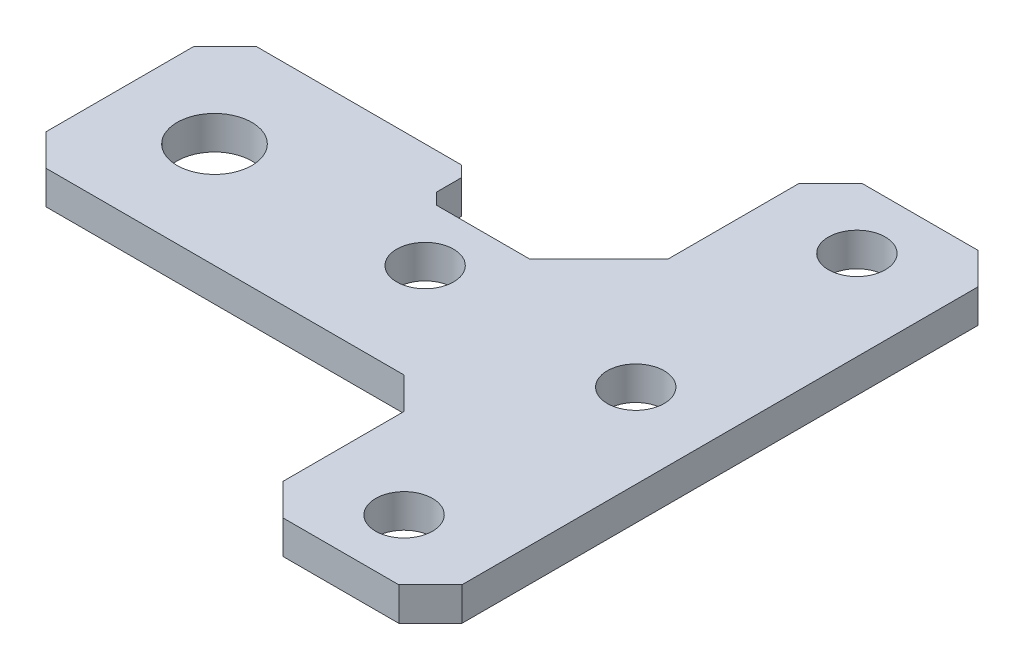
ISO-10303-21;
HEADER;
FILE_DESCRIPTION(('STEP AP214'),'2;1');
FILE_NAME('part.step','',(''),(''),'','','');
FILE_SCHEMA(('AUTOMOTIVE_DESIGN { 1 0 10303 214 1 1 1 1 }'));
ENDSEC;
DATA;
#1=APPLICATION_CONTEXT('core data for automotive mechanical design processes');
#2=APPLICATION_PROTOCOL_DEFINITION('international standard','automotive_design',2000,#1);
#3=PRODUCT_CONTEXT('',#1,'mechanical');
#4=PRODUCT('Part','Part','',(#3));
#5=PRODUCT_RELATED_PRODUCT_CATEGORY('part','',(#4));
#6=PRODUCT_DEFINITION_FORMATION('','',#4);
#7=PRODUCT_DEFINITION_CONTEXT('part definition',#1,'design');
#8=PRODUCT_DEFINITION('design','',#6,#7);
#9=PRODUCT_DEFINITION_SHAPE('','',#8);
#10=(LENGTH_UNIT() NAMED_UNIT(*) SI_UNIT(.MILLI.,.METRE.));
#11=(NAMED_UNIT(*) PLANE_ANGLE_UNIT() SI_UNIT($,.RADIAN.));
#12=(NAMED_UNIT(*) SI_UNIT($,.STERADIAN.) SOLID_ANGLE_UNIT());
#13=UNCERTAINTY_MEASURE_WITH_UNIT(LENGTH_MEASURE(1.E-05),#10,'distance_accuracy_value','');
#14=(GEOMETRIC_REPRESENTATION_CONTEXT(3) GLOBAL_UNCERTAINTY_ASSIGNED_CONTEXT((#13)) GLOBAL_UNIT_ASSIGNED_CONTEXT((#10,
#11,#12)) REPRESENTATION_CONTEXT('',''));
#15=CARTESIAN_POINT('',(0.,0.,0.));
#16=DIRECTION('',(0.,0.,1.));
#17=DIRECTION('',(1.,0.,0.));
#18=AXIS2_PLACEMENT_3D('',#15,#16,#17);
#19=CARTESIAN_POINT('',(0.,3.175,-20.));
#20=DIRECTION('',(0.,0.,1.));
#21=DIRECTION('',(1.,0.,0.));
#22=AXIS2_PLACEMENT_3D('',#19,#20,#21);
#23=PLANE('',#22);
#24=DIRECTION('',(-1.,0.,0.));
#25=VECTOR('',#24,1.);
#26=CARTESIAN_POINT('',(0.,3.175,-20.));
#27=LINE('',#26,#25);
#28=CARTESIAN_POINT('',(22.4393398282202,3.175,-20.));
#29=VERTEX_POINT('',#28);
#30=CARTESIAN_POINT('',(3.,3.175,-20.));
#31=VERTEX_POINT('',#30);
#32=EDGE_CURVE('E210',#29,#31,#27,.T.);
#33=ORIENTED_EDGE('',*,*,#32,.F.);
#34=DIRECTION('',(0.,-1.,0.));
#35=VECTOR('',#34,1.);
#36=CARTESIAN_POINT('',(22.4393398282202,3.175,-20.));
#37=LINE('',#36,#35);
#38=CARTESIAN_POINT('',(22.4393398282202,0.,-20.));
#39=VERTEX_POINT('',#38);
#40=EDGE_CURVE('E264',#29,#39,#37,.T.);
#41=ORIENTED_EDGE('',*,*,#40,.T.);
#42=DIRECTION('',(-1.,0.,0.));
#43=VECTOR('',#42,1.);
#44=CARTESIAN_POINT('',(0.,0.,-20.));
#45=LINE('',#44,#43);
#46=CARTESIAN_POINT('',(3.,0.,-20.));
#47=VERTEX_POINT('',#46);
#48=EDGE_CURVE('E197',#39,#47,#45,.T.);
#49=ORIENTED_EDGE('',*,*,#48,.T.);
#50=DIRECTION('',(0.,1.,0.));
#51=VECTOR('',#50,1.);
#52=CARTESIAN_POINT('',(3.,3.175,-20.));
#53=LINE('',#52,#51);
#54=EDGE_CURVE('E227',#47,#31,#53,.T.);
#55=ORIENTED_EDGE('',*,*,#54,.T.);
#56=EDGE_LOOP('',(#33,#41,#49,#55));
#57=FACE_BOUND('',#56,.T.);
#58=ADVANCED_FACE('F33',(#57),#23,.F.);
#59=CARTESIAN_POINT('',(0.,3.175,0.));
#60=DIRECTION('',(0.,-1.,0.));
#61=DIRECTION('',(0.,0.,-1.));
#62=AXIS2_PLACEMENT_3D('',#59,#60,#61);
#63=PLANE('',#62);
#64=DIRECTION('',(0.,0.,1.));
#65=VECTOR('',#64,1.);
#66=CARTESIAN_POINT('',(23.5,3.175,-16.5606601717798));
#67=LINE('',#66,#65);
#68=CARTESIAN_POINT('',(23.5,3.175,-18.9393398282202));
#69=VERTEX_POINT('',#68);
#70=CARTESIAN_POINT('',(23.5,3.175,-16.5606601717798));
#71=VERTEX_POINT('',#70);
#72=EDGE_CURVE('E423',#69,#71,#67,.T.);
#73=ORIENTED_EDGE('',*,*,#72,.F.);
#74=DIRECTION('',(0.707106781186548,0.,0.707106781186548));
#75=VECTOR('',#74,1.);
#76=CARTESIAN_POINT('',(22.4393398282202,3.175,-20.));
#77=LINE('',#76,#75);
#78=EDGE_CURVE('E271',#69,#29,#77,.F.);
#79=ORIENTED_EDGE('',*,*,#78,.T.);
#80=ORIENTED_EDGE('',*,*,#32,.T.);
#81=DIRECTION('',(0.707106781186548,0.,-0.707106781186547));
#82=VECTOR('',#81,1.);
#83=CARTESIAN_POINT('',(0.,3.175,-17.));
#84=LINE('',#83,#82);
#85=CARTESIAN_POINT('',(0.,3.175,-17.));
#86=VERTEX_POINT('',#85);
#87=EDGE_CURVE('E240',#31,#86,#84,.F.);
#88=ORIENTED_EDGE('',*,*,#87,.T.);
#89=DIRECTION('',(0.,0.,1.));
#90=VECTOR('',#89,1.);
#91=CARTESIAN_POINT('',(0.,3.175,0.));
#92=LINE('',#91,#90);
#93=CARTESIAN_POINT('',(0.,3.175,-3.));
#94=VERTEX_POINT('',#93);
#95=EDGE_CURVE('E200',#86,#94,#92,.T.);
#96=ORIENTED_EDGE('',*,*,#95,.T.);
#97=DIRECTION('',(-0.707106781186547,0.,-0.707106781186548));
#98=VECTOR('',#97,1.);
#99=CARTESIAN_POINT('',(3.,3.175,0.));
#100=LINE('',#99,#98);
#101=CARTESIAN_POINT('',(3.,3.175,0.));
#102=VERTEX_POINT('',#101);
#103=EDGE_CURVE('E238',#94,#102,#100,.F.);
#104=ORIENTED_EDGE('',*,*,#103,.T.);
#105=DIRECTION('',(1.,0.,0.));
#106=VECTOR('',#105,1.);
#107=CARTESIAN_POINT('',(0.,3.175,0.));
#108=LINE('',#107,#106);
#109=CARTESIAN_POINT('',(37.,3.175,0.));
#110=VERTEX_POINT('',#109);
#111=EDGE_CURVE('E345',#102,#110,#108,.T.);
#112=ORIENTED_EDGE('',*,*,#111,.T.);
#113=DIRECTION('',(-0.707106781186544,0.,-0.707106781186551));
#114=VECTOR('',#113,1.);
#115=CARTESIAN_POINT('',(18.5000000000002,3.175,-18.5));
#116=LINE('',#115,#114);
#117=CARTESIAN_POINT('',(40.,3.175,3.00000000000002));
#118=VERTEX_POINT('',#117);
#119=EDGE_CURVE('E11',#110,#118,#116,.F.);
#120=ORIENTED_EDGE('',*,*,#119,.T.);
#121=DIRECTION('',(0.,0.,1.));
#122=VECTOR('',#121,1.);
#123=CARTESIAN_POINT('',(40.,3.175,17.5));
#124=LINE('',#123,#122);
#125=CARTESIAN_POINT('',(40.,3.175,14.5));
#126=VERTEX_POINT('',#125);
#127=EDGE_CURVE('E281',#118,#126,#124,.T.);
#128=ORIENTED_EDGE('',*,*,#127,.T.);
#129=DIRECTION('',(-0.707106781186546,0.,-0.707106781186549));
#130=VECTOR('',#129,1.);
#131=CARTESIAN_POINT('',(43.,3.175,17.5));
#132=LINE('',#131,#130);
#133=CARTESIAN_POINT('',(43.,3.175,17.5));
#134=VERTEX_POINT('',#133);
#135=EDGE_CURVE('E234',#126,#134,#132,.F.);
#136=ORIENTED_EDGE('',*,*,#135,.T.);
#137=DIRECTION('',(1.,0.,0.));
#138=VECTOR('',#137,1.);
#139=CARTESIAN_POINT('',(40.,3.175,17.5));
#140=LINE('',#139,#138);
#141=CARTESIAN_POINT('',(54.,3.175,17.5));
#142=VERTEX_POINT('',#141);
#143=EDGE_CURVE('E322',#134,#142,#140,.T.);
#144=ORIENTED_EDGE('',*,*,#143,.T.);
#145=DIRECTION('',(-0.707106781186548,0.,0.707106781186547));
#146=VECTOR('',#145,1.);
#147=CARTESIAN_POINT('',(57.,3.175,14.5));
#148=LINE('',#147,#146);
#149=CARTESIAN_POINT('',(57.,3.175,14.5));
#150=VERTEX_POINT('',#149);
#151=EDGE_CURVE('E236',#142,#150,#148,.F.);
#152=ORIENTED_EDGE('',*,*,#151,.T.);
#153=DIRECTION('',(0.,0.,-1.));
#154=VECTOR('',#153,1.);
#155=CARTESIAN_POINT('',(57.,3.175,17.5));
#156=LINE('',#155,#154);
#157=CARTESIAN_POINT('',(57.,3.175,-34.5));
#158=VERTEX_POINT('',#157);
#159=EDGE_CURVE('E314',#150,#158,#156,.T.);
#160=ORIENTED_EDGE('',*,*,#159,.T.);
#161=DIRECTION('',(0.707106781186548,0.,0.707106781186547));
#162=VECTOR('',#161,1.);
#163=CARTESIAN_POINT('',(54.,3.175,-37.5));
#164=LINE('',#163,#162);
#165=CARTESIAN_POINT('',(54.,3.175,-37.5));
#166=VERTEX_POINT('',#165);
#167=EDGE_CURVE('E232',#158,#166,#164,.F.);
#168=ORIENTED_EDGE('',*,*,#167,.T.);
#169=DIRECTION('',(-1.,0.,0.));
#170=VECTOR('',#169,1.);
#171=CARTESIAN_POINT('',(40.,3.175,-37.5));
#172=LINE('',#171,#170);
#173=CARTESIAN_POINT('',(43.,3.175,-37.5));
#174=VERTEX_POINT('',#173);
#175=EDGE_CURVE('E312',#166,#174,#172,.T.);
#176=ORIENTED_EDGE('',*,*,#175,.T.);
#177=DIRECTION('',(0.70710678118655,0.,-0.707106781186545));
#178=VECTOR('',#177,1.);
#179=CARTESIAN_POINT('',(40.,3.175,-34.5));
#180=LINE('',#179,#178);
#181=CARTESIAN_POINT('',(40.,3.175,-34.5));
#182=VERTEX_POINT('',#181);
#183=EDGE_CURVE('E230',#174,#182,#180,.F.);
#184=ORIENTED_EDGE('',*,*,#183,.T.);
#185=DIRECTION('',(0.,0.,1.));
#186=VECTOR('',#185,1.);
#187=CARTESIAN_POINT('',(40.,3.175,-20.));
#188=LINE('',#187,#186);
#189=CARTESIAN_POINT('',(40.,3.175,-22.0606601717798));
#190=VERTEX_POINT('',#189);
#191=EDGE_CURVE('E319',#182,#190,#188,.T.);
#192=ORIENTED_EDGE('',*,*,#191,.T.);
#193=DIRECTION('',(0.707106781186551,0.,-0.707106781186544));
#194=VECTOR('',#193,1.);
#195=CARTESIAN_POINT('',(31.8393398282202,3.175,-13.9));
#196=LINE('',#195,#194);
#197=CARTESIAN_POINT('',(33.4393398282202,3.175,-15.5));
#198=VERTEX_POINT('',#197);
#199=EDGE_CURVE('E188',#198,#190,#196,.T.);
#200=ORIENTED_EDGE('',*,*,#199,.F.);
#201=DIRECTION('',(-1.,0.,0.));
#202=VECTOR('',#201,1.);
#203=CARTESIAN_POINT('',(24.5606601717798,3.175,-15.5));
#204=LINE('',#203,#202);
#205=CARTESIAN_POINT('',(24.5606601717798,3.175,-15.5));
#206=VERTEX_POINT('',#205);
#207=EDGE_CURVE('E182',#198,#206,#204,.T.);
#208=ORIENTED_EDGE('',*,*,#207,.T.);
#209=DIRECTION('',(0.707106781186551,0.,0.707106781186544));
#210=VECTOR('',#209,1.);
#211=CARTESIAN_POINT('',(23.5,3.175,-16.5606601717798));
#212=LINE('',#211,#210);
#213=EDGE_CURVE('E425',#71,#206,#212,.T.);
#214=ORIENTED_EDGE('',*,*,#213,.F.);
#215=EDGE_LOOP('',(#73,#79,#80,#88,#96,#104,#112,#120,#128,#136,#144,#152,#160,#168,#176,#184,
#192,#200,#208,#214));
#216=FACE_BOUND('',#215,.T.);
#217=CARTESIAN_POINT('',(29.,3.175,-10.));
#218=DIRECTION('',(0.,1.,0.));
#219=DIRECTION('',(0.,0.,1.));
#220=AXIS2_PLACEMENT_3D('',#217,#218,#219);
#221=CIRCLE('',#220,2.7);
#222=CARTESIAN_POINT('',(29.,3.175,-7.3));
#223=VERTEX_POINT('',#222);
#224=EDGE_CURVE('E327',#223,#223,#221,.T.);
#225=ORIENTED_EDGE('',*,*,#224,.F.);
#226=EDGE_LOOP('',(#225));
#227=FACE_BOUND('',#226,.T.);
#228=CARTESIAN_POINT('',(9.,3.175,-10.));
#229=DIRECTION('',(0.,1.,0.));
#230=DIRECTION('',(0.,0.,1.));
#231=AXIS2_PLACEMENT_3D('',#228,#229,#230);
#232=CIRCLE('',#231,3.55);
#233=CARTESIAN_POINT('',(9.,3.175,-6.45));
#234=VERTEX_POINT('',#233);
#235=EDGE_CURVE('E337',#234,#234,#232,.T.);
#236=ORIENTED_EDGE('',*,*,#235,.F.);
#237=EDGE_LOOP('',(#236));
#238=FACE_BOUND('',#237,.T.);
#239=CARTESIAN_POINT('',(48.5,3.175,-31.5));
#240=DIRECTION('',(0.,1.,0.));
#241=DIRECTION('',(0.,0.,1.));
#242=AXIS2_PLACEMENT_3D('',#239,#240,#241);
#243=CIRCLE('',#242,2.7);
#244=CARTESIAN_POINT('',(48.5,3.175,-28.8));
#245=VERTEX_POINT('',#244);
#246=EDGE_CURVE('E447',#245,#245,#243,.T.);
#247=ORIENTED_EDGE('',*,*,#246,.F.);
#248=EDGE_LOOP('',(#247));
#249=FACE_BOUND('',#248,.T.);
#250=CARTESIAN_POINT('',(48.5,3.175,11.5));
#251=DIRECTION('',(0.,1.,0.));
#252=DIRECTION('',(0.,0.,1.));
#253=AXIS2_PLACEMENT_3D('',#250,#251,#252);
#254=CIRCLE('',#253,2.70000000000001);
#255=CARTESIAN_POINT('',(48.5,3.175,14.2));
#256=VERTEX_POINT('',#255);
#257=EDGE_CURVE('E441',#256,#256,#254,.T.);
#258=ORIENTED_EDGE('',*,*,#257,.F.);
#259=EDGE_LOOP('',(#258));
#260=FACE_BOUND('',#259,.T.);
#261=CARTESIAN_POINT('',(49.,3.175,-10.));
#262=DIRECTION('',(0.,1.,0.));
#263=DIRECTION('',(0.,0.,1.));
#264=AXIS2_PLACEMENT_3D('',#261,#262,#263);
#265=CIRCLE('',#264,2.7);
#266=CARTESIAN_POINT('',(49.,3.175,-7.30000000000001));
#267=VERTEX_POINT('',#266);
#268=EDGE_CURVE('E435',#267,#267,#265,.T.);
#269=ORIENTED_EDGE('',*,*,#268,.F.);
#270=EDGE_LOOP('',(#269));
#271=FACE_BOUND('',#270,.T.);
#272=ADVANCED_FACE('F310',(#216,#227,#238,#249,#260,#271),#63,.F.);
#273=CARTESIAN_POINT('',(0.,0.,0.));
#274=DIRECTION('',(0.,-1.,0.));
#275=DIRECTION('',(0.,0.,-1.));
#276=AXIS2_PLACEMENT_3D('',#273,#274,#275);
#277=PLANE('',#276);
#278=ORIENTED_EDGE('',*,*,#48,.F.);
#279=DIRECTION('',(-0.707106781186548,0.,-0.707106781186548));
#280=VECTOR('',#279,1.);
#281=CARTESIAN_POINT('',(21.2196699141101,0.,-21.2196699141101));
#282=LINE('',#281,#280);
#283=CARTESIAN_POINT('',(23.5,0.,-18.9393398282202));
#284=VERTEX_POINT('',#283);
#285=EDGE_CURVE('E267',#39,#284,#282,.F.);
#286=ORIENTED_EDGE('',*,*,#285,.T.);
#287=DIRECTION('',(0.,0.,1.));
#288=VECTOR('',#287,1.);
#289=CARTESIAN_POINT('',(23.5,0.,-16.5606601717798));
#290=LINE('',#289,#288);
#291=CARTESIAN_POINT('',(23.5,0.,-16.5606601717798));
#292=VERTEX_POINT('',#291);
#293=EDGE_CURVE('E181',#284,#292,#290,.T.);
#294=ORIENTED_EDGE('',*,*,#293,.T.);
#295=DIRECTION('',(0.707106781186551,0.,0.707106781186544));
#296=VECTOR('',#295,1.);
#297=CARTESIAN_POINT('',(23.5,0.,-16.5606601717798));
#298=LINE('',#297,#296);
#299=CARTESIAN_POINT('',(24.5606601717798,0.,-15.5));
#300=VERTEX_POINT('',#299);
#301=EDGE_CURVE('E432',#292,#300,#298,.T.);
#302=ORIENTED_EDGE('',*,*,#301,.T.);
#303=DIRECTION('',(1.,0.,0.));
#304=VECTOR('',#303,1.);
#305=CARTESIAN_POINT('',(24.5606601717798,0.,-15.5));
#306=LINE('',#305,#304);
#307=CARTESIAN_POINT('',(33.4393398282202,0.,-15.5));
#308=VERTEX_POINT('',#307);
#309=EDGE_CURVE('E178',#300,#308,#306,.T.);
#310=ORIENTED_EDGE('',*,*,#309,.T.);
#311=DIRECTION('',(0.707106781186551,0.,-0.707106781186544));
#312=VECTOR('',#311,1.);
#313=CARTESIAN_POINT('',(31.8393398282202,0.,-13.9));
#314=LINE('',#313,#312);
#315=CARTESIAN_POINT('',(40.,0.,-22.0606601717798));
#316=VERTEX_POINT('',#315);
#317=EDGE_CURVE('E169',#308,#316,#314,.T.);
#318=ORIENTED_EDGE('',*,*,#317,.T.);
#319=DIRECTION('',(0.,0.,1.));
#320=VECTOR('',#319,1.);
#321=CARTESIAN_POINT('',(40.,0.,-20.));
#322=LINE('',#321,#320);
#323=CARTESIAN_POINT('',(40.,0.,-34.5));
#324=VERTEX_POINT('',#323);
#325=EDGE_CURVE('E175',#324,#316,#322,.T.);
#326=ORIENTED_EDGE('',*,*,#325,.F.);
#327=DIRECTION('',(-0.70710678118655,0.,0.707106781186545));
#328=VECTOR('',#327,1.);
#329=CARTESIAN_POINT('',(2.74999999999986,0.,2.74999999999988));
#330=LINE('',#329,#328);
#331=CARTESIAN_POINT('',(43.,0.,-37.5));
#332=VERTEX_POINT('',#331);
#333=EDGE_CURVE('E213',#324,#332,#330,.F.);
#334=ORIENTED_EDGE('',*,*,#333,.T.);
#335=DIRECTION('',(-1.,0.,0.));
#336=VECTOR('',#335,1.);
#337=CARTESIAN_POINT('',(40.,0.,-37.5));
#338=LINE('',#337,#336);
#339=CARTESIAN_POINT('',(54.,0.,-37.5));
#340=VERTEX_POINT('',#339);
#341=EDGE_CURVE('E198',#340,#332,#338,.T.);
#342=ORIENTED_EDGE('',*,*,#341,.F.);
#343=DIRECTION('',(-0.707106781186548,0.,-0.707106781186547));
#344=VECTOR('',#343,1.);
#345=CARTESIAN_POINT('',(45.7499999999999,0.,-45.75));
#346=LINE('',#345,#344);
#347=CARTESIAN_POINT('',(57.,0.,-34.5));
#348=VERTEX_POINT('',#347);
#349=EDGE_CURVE('E215',#340,#348,#346,.F.);
#350=ORIENTED_EDGE('',*,*,#349,.T.);
#351=DIRECTION('',(0.,0.,-1.));
#352=VECTOR('',#351,1.);
#353=CARTESIAN_POINT('',(57.,0.,17.5));
#354=LINE('',#353,#352);
#355=CARTESIAN_POINT('',(57.,0.,14.5));
#356=VERTEX_POINT('',#355);
#357=EDGE_CURVE('E203',#356,#348,#354,.T.);
#358=ORIENTED_EDGE('',*,*,#357,.F.);
#359=DIRECTION('',(0.707106781186548,0.,-0.707106781186547));
#360=VECTOR('',#359,1.);
#361=CARTESIAN_POINT('',(35.7499999999999,0.,35.75));
#362=LINE('',#361,#360);
#363=CARTESIAN_POINT('',(54.,0.,17.5));
#364=VERTEX_POINT('',#363);
#365=EDGE_CURVE('E220',#356,#364,#362,.F.);
#366=ORIENTED_EDGE('',*,*,#365,.T.);
#367=DIRECTION('',(1.,0.,0.));
#368=VECTOR('',#367,1.);
#369=CARTESIAN_POINT('',(40.,0.,17.5));
#370=LINE('',#369,#368);
#371=CARTESIAN_POINT('',(43.,0.,17.5));
#372=VERTEX_POINT('',#371);
#373=EDGE_CURVE('E286',#372,#364,#370,.T.);
#374=ORIENTED_EDGE('',*,*,#373,.F.);
#375=DIRECTION('',(0.707106781186546,0.,0.707106781186549));
#376=VECTOR('',#375,1.);
#377=CARTESIAN_POINT('',(12.7500000000001,0.,-12.75));
#378=LINE('',#377,#376);
#379=CARTESIAN_POINT('',(40.,0.,14.5));
#380=VERTEX_POINT('',#379);
#381=EDGE_CURVE('E217',#372,#380,#378,.F.);
#382=ORIENTED_EDGE('',*,*,#381,.T.);
#383=DIRECTION('',(0.,0.,1.));
#384=VECTOR('',#383,1.);
#385=CARTESIAN_POINT('',(40.,0.,17.5));
#386=LINE('',#385,#384);
#387=CARTESIAN_POINT('',(40.,0.,3.00000000000002));
#388=VERTEX_POINT('',#387);
#389=EDGE_CURVE('E280',#388,#380,#386,.T.);
#390=ORIENTED_EDGE('',*,*,#389,.F.);
#391=DIRECTION('',(0.707106781186544,0.,0.707106781186551));
#392=VECTOR('',#391,1.);
#393=CARTESIAN_POINT('',(40.,0.,3.00000000000002));
#394=LINE('',#393,#392);
#395=CARTESIAN_POINT('',(37.,0.,0.));
#396=VERTEX_POINT('',#395);
#397=EDGE_CURVE('E41',#388,#396,#394,.F.);
#398=ORIENTED_EDGE('',*,*,#397,.T.);
#399=DIRECTION('',(1.,0.,0.));
#400=VECTOR('',#399,1.);
#401=CARTESIAN_POINT('',(0.,0.,0.));
#402=LINE('',#401,#400);
#403=CARTESIAN_POINT('',(3.,0.,0.));
#404=VERTEX_POINT('',#403);
#405=EDGE_CURVE('E287',#404,#396,#402,.T.);
#406=ORIENTED_EDGE('',*,*,#405,.F.);
#407=DIRECTION('',(0.707106781186547,0.,0.707106781186548));
#408=VECTOR('',#407,1.);
#409=CARTESIAN_POINT('',(1.5,0.,-1.5));
#410=LINE('',#409,#408);
#411=CARTESIAN_POINT('',(0.,0.,-3.));
#412=VERTEX_POINT('',#411);
#413=EDGE_CURVE('E222',#404,#412,#410,.F.);
#414=ORIENTED_EDGE('',*,*,#413,.T.);
#415=DIRECTION('',(0.,0.,1.));
#416=VECTOR('',#415,1.);
#417=CARTESIAN_POINT('',(0.,0.,0.));
#418=LINE('',#417,#416);
#419=CARTESIAN_POINT('',(0.,0.,-17.));
#420=VERTEX_POINT('',#419);
#421=EDGE_CURVE('E291',#420,#412,#418,.T.);
#422=ORIENTED_EDGE('',*,*,#421,.F.);
#423=DIRECTION('',(-0.707106781186548,0.,0.707106781186547));
#424=VECTOR('',#423,1.);
#425=CARTESIAN_POINT('',(-8.5,0.,-8.50000000000002));
#426=LINE('',#425,#424);
#427=EDGE_CURVE('E224',#420,#47,#426,.F.);
#428=ORIENTED_EDGE('',*,*,#427,.T.);
#429=EDGE_LOOP('',(#278,#286,#294,#302,#310,#318,#326,#334,#342,#350,#358,#366,#374,#382,#390,
#398,#406,#414,#422,#428));
#430=FACE_BOUND('',#429,.T.);
#431=CARTESIAN_POINT('',(48.5,0.,11.5));
#432=DIRECTION('',(0.,1.,0.));
#433=DIRECTION('',(0.,0.,1.));
#434=AXIS2_PLACEMENT_3D('',#431,#432,#433);
#435=CIRCLE('',#434,2.70000000000001);
#436=CARTESIAN_POINT('',(48.5,0.,14.2));
#437=VERTEX_POINT('',#436);
#438=EDGE_CURVE('E438',#437,#437,#435,.T.);
#439=ORIENTED_EDGE('',*,*,#438,.T.);
#440=EDGE_LOOP('',(#439));
#441=FACE_BOUND('',#440,.T.);
#442=CARTESIAN_POINT('',(9.,0.,-10.));
#443=DIRECTION('',(0.,1.,0.));
#444=DIRECTION('',(0.,0.,1.));
#445=AXIS2_PLACEMENT_3D('',#442,#443,#444);
#446=CIRCLE('',#445,3.55);
#447=CARTESIAN_POINT('',(9.,0.,-6.45));
#448=VERTEX_POINT('',#447);
#449=EDGE_CURVE('E340',#448,#448,#446,.T.);
#450=ORIENTED_EDGE('',*,*,#449,.T.);
#451=EDGE_LOOP('',(#450));
#452=FACE_BOUND('',#451,.T.);
#453=CARTESIAN_POINT('',(29.,0.,-10.));
#454=DIRECTION('',(0.,1.,0.));
#455=DIRECTION('',(0.,0.,1.));
#456=AXIS2_PLACEMENT_3D('',#453,#454,#455);
#457=CIRCLE('',#456,2.7);
#458=CARTESIAN_POINT('',(29.,0.,-7.3));
#459=VERTEX_POINT('',#458);
#460=EDGE_CURVE('E332',#459,#459,#457,.T.);
#461=ORIENTED_EDGE('',*,*,#460,.T.);
#462=EDGE_LOOP('',(#461));
#463=FACE_BOUND('',#462,.T.);
#464=CARTESIAN_POINT('',(48.5,0.,-31.5));
#465=DIRECTION('',(0.,1.,0.));
#466=DIRECTION('',(0.,0.,1.));
#467=AXIS2_PLACEMENT_3D('',#464,#465,#466);
#468=CIRCLE('',#467,2.7);
#469=CARTESIAN_POINT('',(48.5,0.,-28.8));
#470=VERTEX_POINT('',#469);
#471=EDGE_CURVE('E444',#470,#470,#468,.T.);
#472=ORIENTED_EDGE('',*,*,#471,.T.);
#473=EDGE_LOOP('',(#472));
#474=FACE_BOUND('',#473,.T.);
#475=CARTESIAN_POINT('',(49.,0.,-10.));
#476=DIRECTION('',(0.,1.,0.));
#477=DIRECTION('',(0.,0.,1.));
#478=AXIS2_PLACEMENT_3D('',#475,#476,#477);
#479=CIRCLE('',#478,2.7);
#480=CARTESIAN_POINT('',(49.,0.,-7.30000000000001));
#481=VERTEX_POINT('',#480);
#482=EDGE_CURVE('E434',#481,#481,#479,.T.);
#483=ORIENTED_EDGE('',*,*,#482,.T.);
#484=EDGE_LOOP('',(#483));
#485=FACE_BOUND('',#484,.T.);
#486=ADVANCED_FACE('F172',(#430,#441,#452,#463,#474,#485),#277,.T.);
#487=CARTESIAN_POINT('',(0.,3.175,0.));
#488=DIRECTION('',(1.,0.,0.));
#489=DIRECTION('',(0.,0.,-1.));
#490=AXIS2_PLACEMENT_3D('',#487,#488,#489);
#491=PLANE('',#490);
#492=ORIENTED_EDGE('',*,*,#95,.F.);
#493=DIRECTION('',(0.,-1.,0.));
#494=VECTOR('',#493,1.);
#495=CARTESIAN_POINT('',(0.,3.175,-17.));
#496=LINE('',#495,#494);
#497=EDGE_CURVE('E209',#86,#420,#496,.T.);
#498=ORIENTED_EDGE('',*,*,#497,.T.);
#499=ORIENTED_EDGE('',*,*,#421,.T.);
#500=DIRECTION('',(0.,1.,0.));
#501=VECTOR('',#500,1.);
#502=CARTESIAN_POINT('',(0.,3.175,-3.));
#503=LINE('',#502,#501);
#504=EDGE_CURVE('E207',#412,#94,#503,.T.);
#505=ORIENTED_EDGE('',*,*,#504,.T.);
#506=EDGE_LOOP('',(#492,#498,#499,#505));
#507=FACE_BOUND('',#506,.T.);
#508=ADVANCED_FACE('F393',(#507),#491,.F.);
#509=CARTESIAN_POINT('',(0.,3.175,0.));
#510=DIRECTION('',(0.,0.,-1.));
#511=DIRECTION('',(-1.,0.,0.));
#512=AXIS2_PLACEMENT_3D('',#509,#510,#511);
#513=PLANE('',#512);
#514=ORIENTED_EDGE('',*,*,#405,.T.);
#515=DIRECTION('',(0.,1.,0.));
#516=VECTOR('',#515,1.);
#517=CARTESIAN_POINT('',(37.,3.175,0.));
#518=LINE('',#517,#516);
#519=EDGE_CURVE('E54',#396,#110,#518,.T.);
#520=ORIENTED_EDGE('',*,*,#519,.T.);
#521=ORIENTED_EDGE('',*,*,#111,.F.);
#522=DIRECTION('',(0.,-1.,0.));
#523=VECTOR('',#522,1.);
#524=CARTESIAN_POINT('',(3.,3.175,0.));
#525=LINE('',#524,#523);
#526=EDGE_CURVE('E242',#102,#404,#525,.T.);
#527=ORIENTED_EDGE('',*,*,#526,.T.);
#528=EDGE_LOOP('',(#514,#520,#521,#527));
#529=FACE_BOUND('',#528,.T.);
#530=ADVANCED_FACE('F390',(#529),#513,.F.);
#531=CARTESIAN_POINT('',(40.,3.175,17.5));
#532=DIRECTION('',(1.,0.,0.));
#533=DIRECTION('',(0.,0.,-1.));
#534=AXIS2_PLACEMENT_3D('',#531,#532,#533);
#535=PLANE('',#534);
#536=ORIENTED_EDGE('',*,*,#127,.F.);
#537=DIRECTION('',(0.,-1.,0.));
#538=VECTOR('',#537,1.);
#539=CARTESIAN_POINT('',(40.,0.,3.00000000000002));
#540=LINE('',#539,#538);
#541=EDGE_CURVE('E273',#118,#388,#540,.T.);
#542=ORIENTED_EDGE('',*,*,#541,.T.);
#543=ORIENTED_EDGE('',*,*,#389,.T.);
#544=DIRECTION('',(0.,1.,0.));
#545=VECTOR('',#544,1.);
#546=CARTESIAN_POINT('',(40.,3.175,14.5));
#547=LINE('',#546,#545);
#548=EDGE_CURVE('E255',#380,#126,#547,.T.);
#549=ORIENTED_EDGE('',*,*,#548,.T.);
#550=EDGE_LOOP('',(#536,#542,#543,#549));
#551=FACE_BOUND('',#550,.T.);
#552=ADVANCED_FACE('F279',(#551),#535,.F.);
#553=CARTESIAN_POINT('',(40.,3.175,17.5));
#554=DIRECTION('',(0.,0.,-1.));
#555=DIRECTION('',(-1.,0.,0.));
#556=AXIS2_PLACEMENT_3D('',#553,#554,#555);
#557=PLANE('',#556);
#558=ORIENTED_EDGE('',*,*,#373,.T.);
#559=DIRECTION('',(0.,1.,0.));
#560=VECTOR('',#559,1.);
#561=CARTESIAN_POINT('',(54.,3.175,17.5));
#562=LINE('',#561,#560);
#563=EDGE_CURVE('E253',#364,#142,#562,.T.);
#564=ORIENTED_EDGE('',*,*,#563,.T.);
#565=ORIENTED_EDGE('',*,*,#143,.F.);
#566=DIRECTION('',(0.,-1.,0.));
#567=VECTOR('',#566,1.);
#568=CARTESIAN_POINT('',(43.,3.175,17.5));
#569=LINE('',#568,#567);
#570=EDGE_CURVE('E250',#134,#372,#569,.T.);
#571=ORIENTED_EDGE('',*,*,#570,.T.);
#572=EDGE_LOOP('',(#558,#564,#565,#571));
#573=FACE_BOUND('',#572,.T.);
#574=ADVANCED_FACE('F356',(#573),#557,.F.);
#575=CARTESIAN_POINT('',(57.,3.175,17.5));
#576=DIRECTION('',(-1.,0.,0.));
#577=DIRECTION('',(0.,0.,1.));
#578=AXIS2_PLACEMENT_3D('',#575,#576,#577);
#579=PLANE('',#578);
#580=ORIENTED_EDGE('',*,*,#159,.F.);
#581=DIRECTION('',(0.,-1.,0.));
#582=VECTOR('',#581,1.);
#583=CARTESIAN_POINT('',(57.,3.175,14.5));
#584=LINE('',#583,#582);
#585=EDGE_CURVE('E247',#150,#356,#584,.T.);
#586=ORIENTED_EDGE('',*,*,#585,.T.);
#587=ORIENTED_EDGE('',*,*,#357,.T.);
#588=DIRECTION('',(0.,1.,0.));
#589=VECTOR('',#588,1.);
#590=CARTESIAN_POINT('',(57.,3.175,-34.5));
#591=LINE('',#590,#589);
#592=EDGE_CURVE('E245',#348,#158,#591,.T.);
#593=ORIENTED_EDGE('',*,*,#592,.T.);
#594=EDGE_LOOP('',(#580,#586,#587,#593));
#595=FACE_BOUND('',#594,.T.);
#596=ADVANCED_FACE('F299',(#595),#579,.F.);
#597=CARTESIAN_POINT('',(40.,3.175,-37.5));
#598=DIRECTION('',(0.,0.,1.));
#599=DIRECTION('',(1.,0.,0.));
#600=AXIS2_PLACEMENT_3D('',#597,#598,#599);
#601=PLANE('',#600);
#602=ORIENTED_EDGE('',*,*,#175,.F.);
#603=DIRECTION('',(0.,-1.,0.));
#604=VECTOR('',#603,1.);
#605=CARTESIAN_POINT('',(54.,3.175,-37.5));
#606=LINE('',#605,#604);
#607=EDGE_CURVE('E260',#166,#340,#606,.T.);
#608=ORIENTED_EDGE('',*,*,#607,.T.);
#609=ORIENTED_EDGE('',*,*,#341,.T.);
#610=DIRECTION('',(0.,1.,0.));
#611=VECTOR('',#610,1.);
#612=CARTESIAN_POINT('',(43.,3.175,-37.5));
#613=LINE('',#612,#611);
#614=EDGE_CURVE('E258',#332,#174,#613,.T.);
#615=ORIENTED_EDGE('',*,*,#614,.T.);
#616=EDGE_LOOP('',(#602,#608,#609,#615));
#617=FACE_BOUND('',#616,.T.);
#618=ADVANCED_FACE('F316',(#617),#601,.F.);
#619=CARTESIAN_POINT('',(40.,3.175,-20.));
#620=DIRECTION('',(1.,0.,0.));
#621=DIRECTION('',(0.,0.,-1.));
#622=AXIS2_PLACEMENT_3D('',#619,#620,#621);
#623=PLANE('',#622);
#624=ORIENTED_EDGE('',*,*,#325,.T.);
#625=DIRECTION('',(0.,-1.,0.));
#626=VECTOR('',#625,1.);
#627=CARTESIAN_POINT('',(40.,6.08921356237302,-22.0606601717798));
#628=LINE('',#627,#626);
#629=EDGE_CURVE('E185',#190,#316,#628,.T.);
#630=ORIENTED_EDGE('',*,*,#629,.F.);
#631=ORIENTED_EDGE('',*,*,#191,.F.);
#632=DIRECTION('',(0.,-1.,0.));
#633=VECTOR('',#632,1.);
#634=CARTESIAN_POINT('',(40.,3.175,-34.5));
#635=LINE('',#634,#633);
#636=EDGE_CURVE('E196',#182,#324,#635,.T.);
#637=ORIENTED_EDGE('',*,*,#636,.T.);
#638=EDGE_LOOP('',(#624,#630,#631,#637));
#639=FACE_BOUND('',#638,.T.);
#640=ADVANCED_FACE('F194',(#639),#623,.F.);
#641=CARTESIAN_POINT('',(29.,3.175,-10.));
#642=DIRECTION('',(0.,-1.,0.));
#643=DIRECTION('',(0.,0.,-1.));
#644=AXIS2_PLACEMENT_3D('',#641,#642,#643);
#645=CYLINDRICAL_SURFACE('',#644,2.7);
#646=ORIENTED_EDGE('',*,*,#224,.T.);
#647=EDGE_LOOP('',(#646));
#648=FACE_BOUND('',#647,.T.);
#649=ORIENTED_EDGE('',*,*,#460,.F.);
#650=EDGE_LOOP('',(#649));
#651=FACE_BOUND('',#650,.T.);
#652=ADVANCED_FACE('F381',(#648,#651),#645,.F.);
#653=CARTESIAN_POINT('',(9.,3.175,-10.));
#654=DIRECTION('',(0.,-1.,0.));
#655=DIRECTION('',(0.,0.,-1.));
#656=AXIS2_PLACEMENT_3D('',#653,#654,#655);
#657=CYLINDRICAL_SURFACE('',#656,3.55);
#658=ORIENTED_EDGE('',*,*,#235,.T.);
#659=EDGE_LOOP('',(#658));
#660=FACE_BOUND('',#659,.T.);
#661=ORIENTED_EDGE('',*,*,#449,.F.);
#662=EDGE_LOOP('',(#661));
#663=FACE_BOUND('',#662,.T.);
#664=ADVANCED_FACE('F459',(#660,#663),#657,.F.);
#665=CARTESIAN_POINT('',(48.5,3.175,-31.5));
#666=DIRECTION('',(0.,-1.,0.));
#667=DIRECTION('',(0.,0.,-1.));
#668=AXIS2_PLACEMENT_3D('',#665,#666,#667);
#669=CYLINDRICAL_SURFACE('',#668,2.7);
#670=ORIENTED_EDGE('',*,*,#246,.T.);
#671=EDGE_LOOP('',(#670));
#672=FACE_BOUND('',#671,.T.);
#673=ORIENTED_EDGE('',*,*,#471,.F.);
#674=EDGE_LOOP('',(#673));
#675=FACE_BOUND('',#674,.T.);
#676=ADVANCED_FACE('F461',(#672,#675),#669,.F.);
#677=CARTESIAN_POINT('',(48.5,3.175,11.5));
#678=DIRECTION('',(0.,-1.,0.));
#679=DIRECTION('',(0.,0.,-1.));
#680=AXIS2_PLACEMENT_3D('',#677,#678,#679);
#681=CYLINDRICAL_SURFACE('',#680,2.70000000000001);
#682=ORIENTED_EDGE('',*,*,#257,.T.);
#683=EDGE_LOOP('',(#682));
#684=FACE_BOUND('',#683,.T.);
#685=ORIENTED_EDGE('',*,*,#438,.F.);
#686=EDGE_LOOP('',(#685));
#687=FACE_BOUND('',#686,.T.);
#688=ADVANCED_FACE('F467',(#684,#687),#681,.F.);
#689=CARTESIAN_POINT('',(49.,3.175,-10.));
#690=DIRECTION('',(0.,-1.,0.));
#691=DIRECTION('',(0.,0.,-1.));
#692=AXIS2_PLACEMENT_3D('',#689,#690,#691);
#693=CYLINDRICAL_SURFACE('',#692,2.7);
#694=ORIENTED_EDGE('',*,*,#268,.T.);
#695=EDGE_LOOP('',(#694));
#696=FACE_BOUND('',#695,.T.);
#697=ORIENTED_EDGE('',*,*,#482,.F.);
#698=EDGE_LOOP('',(#697));
#699=FACE_BOUND('',#698,.T.);
#700=ADVANCED_FACE('F399',(#696,#699),#693,.F.);
#701=CARTESIAN_POINT('',(0.,3.175,-17.));
#702=DIRECTION('',(0.707106781186547,0.,0.707106781186548));
#703=DIRECTION('',(0.,-1.,0.));
#704=AXIS2_PLACEMENT_3D('',#701,#702,#703);
#705=PLANE('',#704);
#706=ORIENTED_EDGE('',*,*,#87,.F.);
#707=ORIENTED_EDGE('',*,*,#54,.F.);
#708=ORIENTED_EDGE('',*,*,#427,.F.);
#709=ORIENTED_EDGE('',*,*,#497,.F.);
#710=EDGE_LOOP('',(#706,#707,#708,#709));
#711=FACE_BOUND('',#710,.T.);
#712=ADVANCED_FACE('F396',(#711),#705,.F.);
#713=CARTESIAN_POINT('',(3.,3.175,0.));
#714=DIRECTION('',(0.707106781186548,0.,-0.707106781186547));
#715=DIRECTION('',(0.,-1.,0.));
#716=AXIS2_PLACEMENT_3D('',#713,#714,#715);
#717=PLANE('',#716);
#718=ORIENTED_EDGE('',*,*,#103,.F.);
#719=ORIENTED_EDGE('',*,*,#504,.F.);
#720=ORIENTED_EDGE('',*,*,#413,.F.);
#721=ORIENTED_EDGE('',*,*,#526,.F.);
#722=EDGE_LOOP('',(#718,#719,#720,#721));
#723=FACE_BOUND('',#722,.T.);
#724=ADVANCED_FACE('F367',(#723),#717,.F.);
#725=CARTESIAN_POINT('',(57.,3.175,14.5));
#726=DIRECTION('',(-0.707106781186547,0.,-0.707106781186548));
#727=DIRECTION('',(0.,-1.,0.));
#728=AXIS2_PLACEMENT_3D('',#725,#726,#727);
#729=PLANE('',#728);
#730=ORIENTED_EDGE('',*,*,#151,.F.);
#731=ORIENTED_EDGE('',*,*,#563,.F.);
#732=ORIENTED_EDGE('',*,*,#365,.F.);
#733=ORIENTED_EDGE('',*,*,#585,.F.);
#734=EDGE_LOOP('',(#730,#731,#732,#733));
#735=FACE_BOUND('',#734,.T.);
#736=ADVANCED_FACE('F355',(#735),#729,.F.);
#737=CARTESIAN_POINT('',(43.,3.175,17.5));
#738=DIRECTION('',(0.707106781186549,0.,-0.707106781186546));
#739=DIRECTION('',(0.,-1.,0.));
#740=AXIS2_PLACEMENT_3D('',#737,#738,#739);
#741=PLANE('',#740);
#742=ORIENTED_EDGE('',*,*,#135,.F.);
#743=ORIENTED_EDGE('',*,*,#548,.F.);
#744=ORIENTED_EDGE('',*,*,#381,.F.);
#745=ORIENTED_EDGE('',*,*,#570,.F.);
#746=EDGE_LOOP('',(#742,#743,#744,#745));
#747=FACE_BOUND('',#746,.T.);
#748=ADVANCED_FACE('F358',(#747),#741,.F.);
#749=CARTESIAN_POINT('',(54.,3.175,-37.5));
#750=DIRECTION('',(-0.707106781186547,0.,0.707106781186548));
#751=DIRECTION('',(0.,-1.,0.));
#752=AXIS2_PLACEMENT_3D('',#749,#750,#751);
#753=PLANE('',#752);
#754=ORIENTED_EDGE('',*,*,#167,.F.);
#755=ORIENTED_EDGE('',*,*,#592,.F.);
#756=ORIENTED_EDGE('',*,*,#349,.F.);
#757=ORIENTED_EDGE('',*,*,#607,.F.);
#758=EDGE_LOOP('',(#754,#755,#756,#757));
#759=FACE_BOUND('',#758,.T.);
#760=ADVANCED_FACE('F304',(#759),#753,.F.);
#761=CARTESIAN_POINT('',(40.,3.175,-34.5));
#762=DIRECTION('',(0.707106781186545,0.,0.70710678118655));
#763=DIRECTION('',(0.,-1.,0.));
#764=AXIS2_PLACEMENT_3D('',#761,#762,#763);
#765=PLANE('',#764);
#766=ORIENTED_EDGE('',*,*,#183,.F.);
#767=ORIENTED_EDGE('',*,*,#614,.F.);
#768=ORIENTED_EDGE('',*,*,#333,.F.);
#769=ORIENTED_EDGE('',*,*,#636,.F.);
#770=EDGE_LOOP('',(#766,#767,#768,#769));
#771=FACE_BOUND('',#770,.T.);
#772=ADVANCED_FACE('F365',(#771),#765,.F.);
#773=CARTESIAN_POINT('',(23.5,-0.00100000000000013,-16.5606601717798));
#774=DIRECTION('',(-1.,0.,0.));
#775=DIRECTION('',(0.,0.,1.));
#776=AXIS2_PLACEMENT_3D('',#773,#774,#775);
#777=PLANE('',#776);
#778=ORIENTED_EDGE('',*,*,#293,.F.);
#779=DIRECTION('',(0.,1.,0.));
#780=VECTOR('',#779,1.);
#781=CARTESIAN_POINT('',(23.5,-0.00100000000000013,-18.9393398282202));
#782=LINE('',#781,#780);
#783=EDGE_CURVE('E269',#284,#69,#782,.T.);
#784=ORIENTED_EDGE('',*,*,#783,.T.);
#785=ORIENTED_EDGE('',*,*,#72,.T.);
#786=DIRECTION('',(0.,1.,0.));
#787=VECTOR('',#786,1.);
#788=CARTESIAN_POINT('',(23.5,-0.00100000000000013,-16.5606601717798));
#789=LINE('',#788,#787);
#790=EDGE_CURVE('E422',#292,#71,#789,.T.);
#791=ORIENTED_EDGE('',*,*,#790,.F.);
#792=EDGE_LOOP('',(#778,#784,#785,#791));
#793=FACE_BOUND('',#792,.T.);
#794=ADVANCED_FACE('F420',(#793),#777,.F.);
#795=CARTESIAN_POINT('',(31.8393398282202,-0.00100000000000013,-13.9));
#796=DIRECTION('',(0.707106781186544,0.,0.707106781186551));
#797=DIRECTION('',(0.707106781186551,0.,-0.707106781186544));
#798=AXIS2_PLACEMENT_3D('',#795,#796,#797);
#799=PLANE('',#798);
#800=ORIENTED_EDGE('',*,*,#317,.F.);
#801=DIRECTION('',(0.,-1.,0.));
#802=VECTOR('',#801,1.);
#803=CARTESIAN_POINT('',(33.4393398282202,12.196693435364,-15.5));
#804=LINE('',#803,#802);
#805=EDGE_CURVE('E495',#198,#308,#804,.T.);
#806=ORIENTED_EDGE('',*,*,#805,.F.);
#807=ORIENTED_EDGE('',*,*,#199,.T.);
#808=ORIENTED_EDGE('',*,*,#629,.T.);
#809=EDGE_LOOP('',(#800,#806,#807,#808));
#810=FACE_BOUND('',#809,.T.);
#811=ADVANCED_FACE('F186',(#810),#799,.F.);
#812=CARTESIAN_POINT('',(23.5,-0.00100000000000013,-16.5606601717798));
#813=DIRECTION('',(-0.707106781186544,0.,0.707106781186551));
#814=DIRECTION('',(0.707106781186551,0.,0.707106781186544));
#815=AXIS2_PLACEMENT_3D('',#812,#813,#814);
#816=PLANE('',#815);
#817=ORIENTED_EDGE('',*,*,#213,.T.);
#818=DIRECTION('',(0.,-1.,0.));
#819=VECTOR('',#818,1.);
#820=CARTESIAN_POINT('',(24.5606601717798,12.196693435364,-15.5));
#821=LINE('',#820,#819);
#822=EDGE_CURVE('E496',#206,#300,#821,.T.);
#823=ORIENTED_EDGE('',*,*,#822,.T.);
#824=ORIENTED_EDGE('',*,*,#301,.F.);
#825=ORIENTED_EDGE('',*,*,#790,.T.);
#826=EDGE_LOOP('',(#817,#823,#824,#825));
#827=FACE_BOUND('',#826,.T.);
#828=ADVANCED_FACE('F480',(#827),#816,.F.);
#829=CARTESIAN_POINT('',(24.5606601717798,12.196693435364,-15.5));
#830=DIRECTION('',(0.,0.,-1.));
#831=DIRECTION('',(-1.,0.,0.));
#832=AXIS2_PLACEMENT_3D('',#829,#830,#831);
#833=PLANE('',#832);
#834=ORIENTED_EDGE('',*,*,#207,.F.);
#835=ORIENTED_EDGE('',*,*,#805,.T.);
#836=ORIENTED_EDGE('',*,*,#309,.F.);
#837=ORIENTED_EDGE('',*,*,#822,.F.);
#838=EDGE_LOOP('',(#834,#835,#836,#837));
#839=FACE_BOUND('',#838,.T.);
#840=ADVANCED_FACE('F483',(#839),#833,.T.);
#841=CARTESIAN_POINT('',(22.4393398282202,3.175,-20.));
#842=DIRECTION('',(-0.707106781186547,0.,0.707106781186547));
#843=DIRECTION('',(0.,-1.,0.));
#844=AXIS2_PLACEMENT_3D('',#841,#842,#843);
#845=PLANE('',#844);
#846=ORIENTED_EDGE('',*,*,#78,.F.);
#847=ORIENTED_EDGE('',*,*,#783,.F.);
#848=ORIENTED_EDGE('',*,*,#285,.F.);
#849=ORIENTED_EDGE('',*,*,#40,.F.);
#850=EDGE_LOOP('',(#846,#847,#848,#849));
#851=FACE_BOUND('',#850,.T.);
#852=ADVANCED_FACE('F414',(#851),#845,.F.);
#853=CARTESIAN_POINT('',(40.,3.175,3.00000000000002));
#854=DIRECTION('',(-0.707106781186551,0.,0.707106781186544));
#855=DIRECTION('',(0.,1.,0.));
#856=AXIS2_PLACEMENT_3D('',#853,#854,#855);
#857=PLANE('',#856);
#858=ORIENTED_EDGE('',*,*,#119,.F.);
#859=ORIENTED_EDGE('',*,*,#519,.F.);
#860=ORIENTED_EDGE('',*,*,#397,.F.);
#861=ORIENTED_EDGE('',*,*,#541,.F.);
#862=EDGE_LOOP('',(#858,#859,#860,#861));
#863=FACE_BOUND('',#862,.T.);
#864=ADVANCED_FACE('F35',(#863),#857,.T.);
#865=CLOSED_SHELL('',(#58,#272,#486,#508,#530,#552,#574,#596,#618,#640,#652,#664,#676,#688,#700,
#712,#724,#736,#748,#760,#772,#794,#811,#828,#840,#852,#864));
#866=MANIFOLD_SOLID_BREP('B2',#865);
#867=ADVANCED_BREP_SHAPE_REPRESENTATION('',(#18,#866),#14);
#868=SHAPE_DEFINITION_REPRESENTATION(#9,#867);
ENDSEC;
END-ISO-10303-21;
